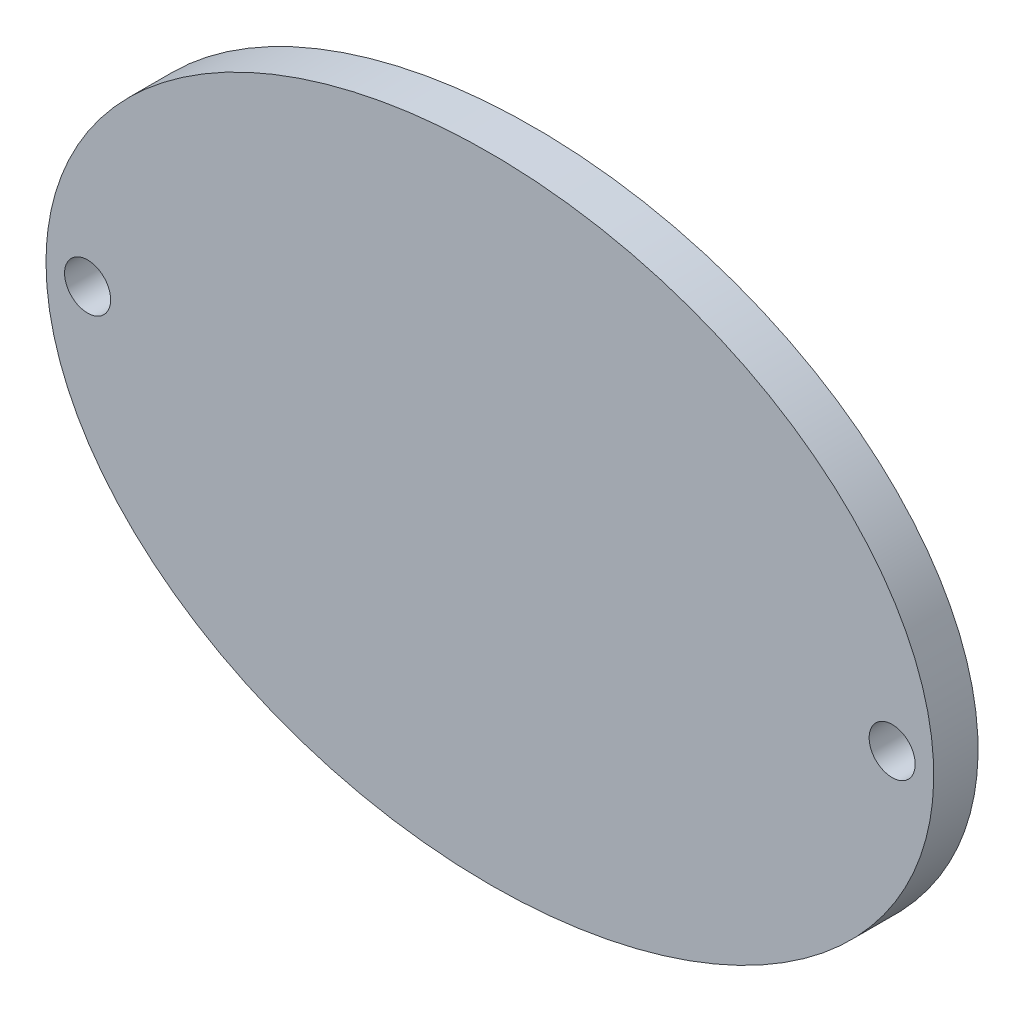
ISO-10303-21;
HEADER;
FILE_DESCRIPTION(('STEP AP214'),'2;1');
FILE_NAME('part.step','',(''),(''),'','','');
FILE_SCHEMA(('AUTOMOTIVE_DESIGN { 1 0 10303 214 1 1 1 1 }'));
ENDSEC;
DATA;
#1=APPLICATION_CONTEXT('core data for automotive mechanical design processes');
#2=APPLICATION_PROTOCOL_DEFINITION('international standard','automotive_design',2000,#1);
#3=PRODUCT_CONTEXT('',#1,'mechanical');
#4=PRODUCT('Part','Part','',(#3));
#5=PRODUCT_RELATED_PRODUCT_CATEGORY('part','',(#4));
#6=PRODUCT_DEFINITION_FORMATION('','',#4);
#7=PRODUCT_DEFINITION_CONTEXT('part definition',#1,'design');
#8=PRODUCT_DEFINITION('design','',#6,#7);
#9=PRODUCT_DEFINITION_SHAPE('','',#8);
#10=(LENGTH_UNIT() NAMED_UNIT(*) SI_UNIT(.MILLI.,.METRE.));
#11=(NAMED_UNIT(*) PLANE_ANGLE_UNIT() SI_UNIT($,.RADIAN.));
#12=(NAMED_UNIT(*) SI_UNIT($,.STERADIAN.) SOLID_ANGLE_UNIT());
#13=UNCERTAINTY_MEASURE_WITH_UNIT(LENGTH_MEASURE(1.E-05),#10,'distance_accuracy_value','');
#14=(GEOMETRIC_REPRESENTATION_CONTEXT(3) GLOBAL_UNCERTAINTY_ASSIGNED_CONTEXT((#13)) GLOBAL_UNIT_ASSIGNED_CONTEXT((#10,
#11,#12)) REPRESENTATION_CONTEXT('',''));
#15=CARTESIAN_POINT('',(0.,0.,0.));
#16=DIRECTION('',(0.,0.,1.));
#17=DIRECTION('',(1.,0.,0.));
#18=AXIS2_PLACEMENT_3D('',#15,#16,#17);
#19=CARTESIAN_POINT('',(0.,0.,3.175));
#20=DIRECTION('',(0.,0.,1.));
#21=DIRECTION('',(-1.,0.,0.));
#22=AXIS2_PLACEMENT_3D('',#19,#20,#21);
#23=ELLIPSE('',#22,31.8,22.7);
#24=DIRECTION('',(0.,0.,-1.));
#25=VECTOR('',#24,1.);
#26=SURFACE_OF_LINEAR_EXTRUSION('',#23,#25);
#27=CARTESIAN_POINT('',(-31.8,0.,3.175));
#28=VERTEX_POINT('',#27);
#29=EDGE_CURVE('E10',#28,#28,#23,.T.);
#30=ORIENTED_EDGE('',*,*,#29,.F.);
#31=EDGE_LOOP('',(#30));
#32=FACE_BOUND('',#31,.T.);
#33=CARTESIAN_POINT('',(0.,0.,0.));
#34=DIRECTION('',(0.,0.,1.));
#35=DIRECTION('',(-1.,0.,0.));
#36=AXIS2_PLACEMENT_3D('',#33,#34,#35);
#37=ELLIPSE('',#36,31.8,22.7);
#38=CARTESIAN_POINT('',(-31.8,0.,0.));
#39=VERTEX_POINT('',#38);
#40=EDGE_CURVE('E38',#39,#39,#37,.T.);
#41=ORIENTED_EDGE('',*,*,#40,.T.);
#42=EDGE_LOOP('',(#41));
#43=FACE_BOUND('',#42,.T.);
#44=ADVANCED_FACE('F34',(#32,#43),#26,.F.);
#45=CARTESIAN_POINT('',(0.,0.,3.175));
#46=DIRECTION('',(0.,0.,1.));
#47=DIRECTION('',(1.,0.,0.));
#48=AXIS2_PLACEMENT_3D('',#45,#46,#47);
#49=PLANE('',#48);
#50=CARTESIAN_POINT('',(28.82,0.,3.175));
#51=DIRECTION('',(0.,0.,-1.));
#52=DIRECTION('',(-1.,0.,0.));
#53=AXIS2_PLACEMENT_3D('',#50,#51,#52);
#54=CIRCLE('',#53,1.65);
#55=CARTESIAN_POINT('',(27.17,0.,3.175));
#56=VERTEX_POINT('',#55);
#57=EDGE_CURVE('E44',#56,#56,#54,.T.);
#58=ORIENTED_EDGE('',*,*,#57,.T.);
#59=EDGE_LOOP('',(#58));
#60=FACE_BOUND('',#59,.T.);
#61=CARTESIAN_POINT('',(-28.82,0.,3.175));
#62=DIRECTION('',(0.,0.,-1.));
#63=DIRECTION('',(-1.,0.,0.));
#64=AXIS2_PLACEMENT_3D('',#61,#62,#63);
#65=CIRCLE('',#64,1.65);
#66=CARTESIAN_POINT('',(-30.47,0.,3.175));
#67=VERTEX_POINT('',#66);
#68=EDGE_CURVE('E50',#67,#67,#65,.T.);
#69=ORIENTED_EDGE('',*,*,#68,.T.);
#70=EDGE_LOOP('',(#69));
#71=FACE_BOUND('',#70,.T.);
#72=ORIENTED_EDGE('',*,*,#29,.T.);
#73=EDGE_LOOP('',(#72));
#74=FACE_BOUND('',#73,.T.);
#75=ADVANCED_FACE('F59',(#60,#71,#74),#49,.T.);
#76=CARTESIAN_POINT('',(0.,0.,0.));
#77=DIRECTION('',(0.,0.,1.));
#78=DIRECTION('',(1.,0.,0.));
#79=AXIS2_PLACEMENT_3D('',#76,#77,#78);
#80=PLANE('',#79);
#81=CARTESIAN_POINT('',(28.82,0.,0.));
#82=DIRECTION('',(0.,0.,-1.));
#83=DIRECTION('',(-1.,0.,0.));
#84=AXIS2_PLACEMENT_3D('',#81,#82,#83);
#85=CIRCLE('',#84,1.65);
#86=CARTESIAN_POINT('',(27.17,0.,0.));
#87=VERTEX_POINT('',#86);
#88=EDGE_CURVE('E53',#87,#87,#85,.T.);
#89=ORIENTED_EDGE('',*,*,#88,.F.);
#90=EDGE_LOOP('',(#89));
#91=FACE_BOUND('',#90,.T.);
#92=CARTESIAN_POINT('',(-28.82,0.,0.));
#93=DIRECTION('',(0.,0.,-1.));
#94=DIRECTION('',(-1.,0.,0.));
#95=AXIS2_PLACEMENT_3D('',#92,#93,#94);
#96=CIRCLE('',#95,1.65);
#97=CARTESIAN_POINT('',(-30.47,0.,0.));
#98=VERTEX_POINT('',#97);
#99=EDGE_CURVE('E47',#98,#98,#96,.T.);
#100=ORIENTED_EDGE('',*,*,#99,.F.);
#101=EDGE_LOOP('',(#100));
#102=FACE_BOUND('',#101,.T.);
#103=ORIENTED_EDGE('',*,*,#40,.F.);
#104=EDGE_LOOP('',(#103));
#105=FACE_BOUND('',#104,.T.);
#106=ADVANCED_FACE('F69',(#91,#102,#105),#80,.F.);
#107=CARTESIAN_POINT('',(-28.82,0.,3.175));
#108=DIRECTION('',(0.,0.,-1.));
#109=DIRECTION('',(-1.,0.,0.));
#110=AXIS2_PLACEMENT_3D('',#107,#108,#109);
#111=CYLINDRICAL_SURFACE('',#110,1.65);
#112=ORIENTED_EDGE('',*,*,#68,.F.);
#113=EDGE_LOOP('',(#112));
#114=FACE_BOUND('',#113,.T.);
#115=ORIENTED_EDGE('',*,*,#99,.T.);
#116=EDGE_LOOP('',(#115));
#117=FACE_BOUND('',#116,.T.);
#118=ADVANCED_FACE('F65',(#114,#117),#111,.F.);
#119=CARTESIAN_POINT('',(28.82,0.,3.175));
#120=DIRECTION('',(0.,0.,-1.));
#121=DIRECTION('',(-1.,0.,0.));
#122=AXIS2_PLACEMENT_3D('',#119,#120,#121);
#123=CYLINDRICAL_SURFACE('',#122,1.65);
#124=ORIENTED_EDGE('',*,*,#57,.F.);
#125=EDGE_LOOP('',(#124));
#126=FACE_BOUND('',#125,.T.);
#127=ORIENTED_EDGE('',*,*,#88,.T.);
#128=EDGE_LOOP('',(#127));
#129=FACE_BOUND('',#128,.T.);
#130=ADVANCED_FACE('F62',(#126,#129),#123,.F.);
#131=CLOSED_SHELL('',(#44,#75,#106,#118,#130));
#132=MANIFOLD_SOLID_BREP('B2',#131);
#133=ADVANCED_BREP_SHAPE_REPRESENTATION('',(#18,#132),#14);
#134=SHAPE_DEFINITION_REPRESENTATION(#9,#133);
ENDSEC;
END-ISO-10303-21;
